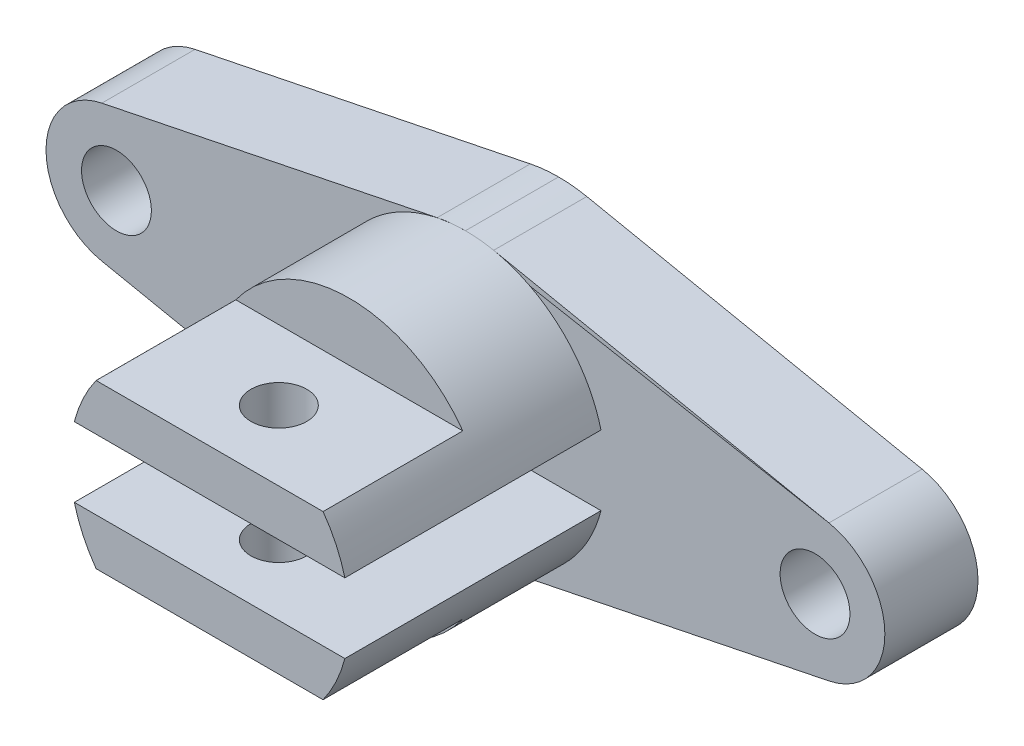
ISO-10303-21;
HEADER;
FILE_DESCRIPTION(('STEP AP214'),'2;1');
FILE_NAME('part.step','',(''),(''),'','','');
FILE_SCHEMA(('AUTOMOTIVE_DESIGN { 1 0 10303 214 1 1 1 1 }'));
ENDSEC;
DATA;
#1=APPLICATION_CONTEXT('core data for automotive mechanical design processes');
#2=APPLICATION_PROTOCOL_DEFINITION('international standard','automotive_design',2000,#1);
#3=PRODUCT_CONTEXT('',#1,'mechanical');
#4=PRODUCT('Part','Part','',(#3));
#5=PRODUCT_RELATED_PRODUCT_CATEGORY('part','',(#4));
#6=PRODUCT_DEFINITION_FORMATION('','',#4);
#7=PRODUCT_DEFINITION_CONTEXT('part definition',#1,'design');
#8=PRODUCT_DEFINITION('design','',#6,#7);
#9=PRODUCT_DEFINITION_SHAPE('','',#8);
#10=(LENGTH_UNIT() NAMED_UNIT(*) SI_UNIT(.MILLI.,.METRE.));
#11=(NAMED_UNIT(*) PLANE_ANGLE_UNIT() SI_UNIT($,.RADIAN.));
#12=(NAMED_UNIT(*) SI_UNIT($,.STERADIAN.) SOLID_ANGLE_UNIT());
#13=UNCERTAINTY_MEASURE_WITH_UNIT(LENGTH_MEASURE(1.E-05),#10,'distance_accuracy_value','');
#14=(GEOMETRIC_REPRESENTATION_CONTEXT(3) GLOBAL_UNCERTAINTY_ASSIGNED_CONTEXT((#13)) GLOBAL_UNIT_ASSIGNED_CONTEXT((#10,
#11,#12)) REPRESENTATION_CONTEXT('',''));
#15=CARTESIAN_POINT('',(0.,0.,0.));
#16=DIRECTION('',(0.,0.,1.));
#17=DIRECTION('',(1.,0.,0.));
#18=AXIS2_PLACEMENT_3D('',#15,#16,#17);
#19=CARTESIAN_POINT('',(-0.129107715143933,0.,20.));
#20=DIRECTION('',(0.,0.,-1.));
#21=DIRECTION('',(-1.,0.,0.));
#22=AXIS2_PLACEMENT_3D('',#19,#20,#21);
#23=PLANE('',#22);
#24=CARTESIAN_POINT('',(75.0000000000321,0.,20.));
#25=DIRECTION('',(0.,0.,1.));
#26=DIRECTION('',(1.,0.,0.));
#27=AXIS2_PLACEMENT_3D('',#24,#25,#26);
#28=CIRCLE('',#27,29.9999317535166);
#29=CARTESIAN_POINT('',(45.9526966346683,-7.50000482774365,20.));
#30=VERTEX_POINT('',#29);
#31=CARTESIAN_POINT('',(104.047303365396,-7.50000482774365,20.));
#32=VERTEX_POINT('',#31);
#33=EDGE_CURVE('E216',#30,#32,#28,.T.);
#34=ORIENTED_EDGE('',*,*,#33,.F.);
#35=DIRECTION('',(-1.,0.,0.));
#36=VECTOR('',#35,1.);
#37=CARTESIAN_POINT('',(45.9526966346683,-7.50000482774365,20.));
#38=LINE('',#37,#36);
#39=EDGE_CURVE('E211',#32,#30,#38,.T.);
#40=ORIENTED_EDGE('',*,*,#39,.F.);
#41=EDGE_LOOP('',(#34,#40));
#42=FACE_BOUND('',#41,.T.);
#43=CARTESIAN_POINT('',(-0.129107715143933,0.,20.));
#44=DIRECTION('',(0.,0.,-1.));
#45=DIRECTION('',(-1.,0.,0.));
#46=AXIS2_PLACEMENT_3D('',#43,#44,#45);
#47=CIRCLE('',#46,15.);
#48=CARTESIAN_POINT('',(-3.12910771514394,-14.696938456699,20.));
#49=VERTEX_POINT('',#48);
#50=CARTESIAN_POINT('',(-3.12910771514394,14.6969384566991,20.));
#51=VERTEX_POINT('',#50);
#52=EDGE_CURVE('E254',#49,#51,#47,.T.);
#53=ORIENTED_EDGE('',*,*,#52,.F.);
#54=DIRECTION('',(0.979795897113271,-0.200000000000001,0.));
#55=VECTOR('',#54,1.);
#56=CARTESIAN_POINT('',(-3.12910771514394,-14.696938456699,20.));
#57=LINE('',#56,#55);
#58=CARTESIAN_POINT('',(68.8708922848561,-29.3938769133981,20.));
#59=VERTEX_POINT('',#58);
#60=EDGE_CURVE('E287',#49,#59,#57,.T.);
#61=ORIENTED_EDGE('',*,*,#60,.T.);
#62=CARTESIAN_POINT('',(74.8708922848561,0.,20.));
#63=DIRECTION('',(0.,0.,-1.));
#64=DIRECTION('',(-1.,0.,0.));
#65=AXIS2_PLACEMENT_3D('',#62,#63,#64);
#66=CIRCLE('',#65,30.);
#67=CARTESIAN_POINT('',(74.935446142428,-29.9999305465775,20.));
#68=VERTEX_POINT('',#67);
#69=EDGE_CURVE('E283',#68,#59,#66,.T.);
#70=ORIENTED_EDGE('',*,*,#69,.F.);
#71=CARTESIAN_POINT('',(75.,0.,20.));
#72=DIRECTION('',(0.,0.,1.));
#73=DIRECTION('',(1.,0.,0.));
#74=AXIS2_PLACEMENT_3D('',#71,#72,#73);
#75=CIRCLE('',#74,30.);
#76=CARTESIAN_POINT('',(81.,-29.3938769133981,20.));
#77=VERTEX_POINT('',#76);
#78=EDGE_CURVE('E280',#68,#77,#75,.T.);
#79=ORIENTED_EDGE('',*,*,#78,.T.);
#80=DIRECTION('',(-0.979795897113271,-0.2,0.));
#81=VECTOR('',#80,1.);
#82=CARTESIAN_POINT('',(153.,-14.6969384566991,20.));
#83=LINE('',#82,#81);
#84=CARTESIAN_POINT('',(153.,-14.6969384566991,20.));
#85=VERTEX_POINT('',#84);
#86=EDGE_CURVE('E276',#85,#77,#83,.T.);
#87=ORIENTED_EDGE('',*,*,#86,.F.);
#88=CARTESIAN_POINT('',(150.,0.,20.));
#89=DIRECTION('',(0.,0.,1.));
#90=DIRECTION('',(1.,0.,0.));
#91=AXIS2_PLACEMENT_3D('',#88,#89,#90);
#92=CIRCLE('',#91,15.);
#93=CARTESIAN_POINT('',(153.,14.6969384566991,20.));
#94=VERTEX_POINT('',#93);
#95=EDGE_CURVE('E273',#85,#94,#92,.T.);
#96=ORIENTED_EDGE('',*,*,#95,.T.);
#97=DIRECTION('',(-0.979795897113271,0.2,0.));
#98=VECTOR('',#97,1.);
#99=CARTESIAN_POINT('',(153.,14.6969384566991,20.));
#100=LINE('',#99,#98);
#101=CARTESIAN_POINT('',(81.,29.3938769133981,20.));
#102=VERTEX_POINT('',#101);
#103=EDGE_CURVE('E270',#94,#102,#100,.T.);
#104=ORIENTED_EDGE('',*,*,#103,.T.);
#105=CARTESIAN_POINT('',(75.,0.,20.));
#106=DIRECTION('',(0.,0.,1.));
#107=DIRECTION('',(1.,0.,0.));
#108=AXIS2_PLACEMENT_3D('',#105,#106,#107);
#109=CIRCLE('',#108,30.);
#110=CARTESIAN_POINT('',(74.935446142428,29.9999305465775,20.));
#111=VERTEX_POINT('',#110);
#112=EDGE_CURVE('E267',#102,#111,#109,.T.);
#113=ORIENTED_EDGE('',*,*,#112,.T.);
#114=CARTESIAN_POINT('',(74.8708922848561,0.,20.));
#115=DIRECTION('',(0.,0.,-1.));
#116=DIRECTION('',(-1.,0.,0.));
#117=AXIS2_PLACEMENT_3D('',#114,#115,#116);
#118=CIRCLE('',#117,30.);
#119=CARTESIAN_POINT('',(68.8708922848561,29.3938769133981,20.));
#120=VERTEX_POINT('',#119);
#121=EDGE_CURVE('E263',#120,#111,#118,.T.);
#122=ORIENTED_EDGE('',*,*,#121,.F.);
#123=DIRECTION('',(0.979795897113272,0.199999999999999,0.));
#124=VECTOR('',#123,1.);
#125=CARTESIAN_POINT('',(-3.12910771514394,14.6969384566991,20.));
#126=LINE('',#125,#124);
#127=EDGE_CURVE('E258',#51,#120,#126,.T.);
#128=ORIENTED_EDGE('',*,*,#127,.F.);
#129=EDGE_LOOP('',(#53,#61,#70,#79,#87,#96,#104,#113,#122,#128));
#130=FACE_BOUND('',#129,.T.);
#131=CARTESIAN_POINT('',(75.0000000000321,0.,20.));
#132=DIRECTION('',(0.,0.,1.));
#133=DIRECTION('',(1.,0.,0.));
#134=AXIS2_PLACEMENT_3D('',#131,#132,#133);
#135=CIRCLE('',#134,29.9999317535166);
#136=CARTESIAN_POINT('',(104.047305858438,7.49999517225635,20.));
#137=VERTEX_POINT('',#136);
#138=CARTESIAN_POINT('',(45.9526941416262,7.49999517225635,20.));
#139=VERTEX_POINT('',#138);
#140=EDGE_CURVE('E220',#137,#139,#135,.T.);
#141=ORIENTED_EDGE('',*,*,#140,.F.);
#142=DIRECTION('',(1.,0.,0.));
#143=VECTOR('',#142,1.);
#144=CARTESIAN_POINT('',(45.9526941416262,7.49999517225635,20.));
#145=LINE('',#144,#143);
#146=EDGE_CURVE('E240',#139,#137,#145,.T.);
#147=ORIENTED_EDGE('',*,*,#146,.F.);
#148=EDGE_LOOP('',(#141,#147));
#149=FACE_BOUND('',#148,.T.);
#150=CARTESIAN_POINT('',(150.002572470873,-0.00643199145704265,20.));
#151=DIRECTION('',(0.,0.,-1.));
#152=DIRECTION('',(-1.,0.,0.));
#153=AXIS2_PLACEMENT_3D('',#150,#151,#152);
#154=CIRCLE('',#153,7.49999999999997);
#155=CARTESIAN_POINT('',(142.502572470873,-0.00643199145704265,20.));
#156=VERTEX_POINT('',#155);
#157=EDGE_CURVE('E371',#156,#156,#154,.T.);
#158=ORIENTED_EDGE('',*,*,#157,.T.);
#159=EDGE_LOOP('',(#158));
#160=FACE_BOUND('',#159,.T.);
#161=CARTESIAN_POINT('',(0.,0.,20.));
#162=DIRECTION('',(0.,0.,1.));
#163=DIRECTION('',(1.,0.,0.));
#164=AXIS2_PLACEMENT_3D('',#161,#162,#163);
#165=CIRCLE('',#164,7.5);
#166=CARTESIAN_POINT('',(7.5,0.,20.));
#167=VERTEX_POINT('',#166);
#168=EDGE_CURVE('E363',#167,#167,#165,.T.);
#169=ORIENTED_EDGE('',*,*,#168,.F.);
#170=EDGE_LOOP('',(#169));
#171=FACE_BOUND('',#170,.T.);
#172=ADVANCED_FACE('F45',(#42,#130,#149,#160,#171),#23,.F.);
#173=CARTESIAN_POINT('',(-0.129107715143933,0.,0.));
#174=DIRECTION('',(0.,0.,-1.));
#175=DIRECTION('',(-1.,0.,0.));
#176=AXIS2_PLACEMENT_3D('',#173,#174,#175);
#177=PLANE('',#176);
#178=CARTESIAN_POINT('',(150.002572470873,-0.00643199145704265,0.));
#179=DIRECTION('',(0.,0.,-1.));
#180=DIRECTION('',(-1.,0.,0.));
#181=AXIS2_PLACEMENT_3D('',#178,#179,#180);
#182=CIRCLE('',#181,7.49999999999997);
#183=CARTESIAN_POINT('',(142.502572470873,-0.00643199145704265,0.));
#184=VERTEX_POINT('',#183);
#185=EDGE_CURVE('E360',#184,#184,#182,.F.);
#186=ORIENTED_EDGE('',*,*,#185,.T.);
#187=EDGE_LOOP('',(#186));
#188=FACE_BOUND('',#187,.T.);
#189=CARTESIAN_POINT('',(-0.129107715143933,0.,0.));
#190=DIRECTION('',(0.,0.,-1.));
#191=DIRECTION('',(-1.,0.,0.));
#192=AXIS2_PLACEMENT_3D('',#189,#190,#191);
#193=CIRCLE('',#192,15.);
#194=CARTESIAN_POINT('',(-3.12910771514394,-14.696938456699,0.));
#195=VERTEX_POINT('',#194);
#196=CARTESIAN_POINT('',(-3.12910771514394,14.6969384566991,0.));
#197=VERTEX_POINT('',#196);
#198=EDGE_CURVE('E230',#195,#197,#193,.T.);
#199=ORIENTED_EDGE('',*,*,#198,.T.);
#200=DIRECTION('',(0.979795897113272,0.199999999999999,0.));
#201=VECTOR('',#200,1.);
#202=CARTESIAN_POINT('',(-3.12910771514394,14.6969384566991,0.));
#203=LINE('',#202,#201);
#204=CARTESIAN_POINT('',(68.8708922848561,29.3938769133981,0.));
#205=VERTEX_POINT('',#204);
#206=EDGE_CURVE('E294',#197,#205,#203,.T.);
#207=ORIENTED_EDGE('',*,*,#206,.T.);
#208=CARTESIAN_POINT('',(74.8708922848561,0.,0.));
#209=DIRECTION('',(0.,0.,-1.));
#210=DIRECTION('',(-1.,0.,0.));
#211=AXIS2_PLACEMENT_3D('',#208,#209,#210);
#212=CIRCLE('',#211,30.);
#213=CARTESIAN_POINT('',(74.935446142428,29.9999305465775,0.));
#214=VERTEX_POINT('',#213);
#215=EDGE_CURVE('E298',#205,#214,#212,.T.);
#216=ORIENTED_EDGE('',*,*,#215,.T.);
#217=CARTESIAN_POINT('',(75.,0.,0.));
#218=DIRECTION('',(0.,0.,1.));
#219=DIRECTION('',(1.,0.,0.));
#220=AXIS2_PLACEMENT_3D('',#217,#218,#219);
#221=CIRCLE('',#220,30.);
#222=CARTESIAN_POINT('',(81.,29.3938769133981,0.));
#223=VERTEX_POINT('',#222);
#224=EDGE_CURVE('E302',#223,#214,#221,.T.);
#225=ORIENTED_EDGE('',*,*,#224,.F.);
#226=DIRECTION('',(-0.979795897113271,0.2,0.));
#227=VECTOR('',#226,1.);
#228=CARTESIAN_POINT('',(153.,14.6969384566991,0.));
#229=LINE('',#228,#227);
#230=CARTESIAN_POINT('',(153.,14.6969384566991,0.));
#231=VERTEX_POINT('',#230);
#232=EDGE_CURVE('E306',#231,#223,#229,.T.);
#233=ORIENTED_EDGE('',*,*,#232,.F.);
#234=CARTESIAN_POINT('',(150.,0.,0.));
#235=DIRECTION('',(0.,0.,1.));
#236=DIRECTION('',(1.,0.,0.));
#237=AXIS2_PLACEMENT_3D('',#234,#235,#236);
#238=CIRCLE('',#237,15.);
#239=CARTESIAN_POINT('',(153.,-14.6969384566991,0.));
#240=VERTEX_POINT('',#239);
#241=EDGE_CURVE('E309',#240,#231,#238,.T.);
#242=ORIENTED_EDGE('',*,*,#241,.F.);
#243=DIRECTION('',(-0.979795897113271,-0.2,0.));
#244=VECTOR('',#243,1.);
#245=CARTESIAN_POINT('',(153.,-14.6969384566991,0.));
#246=LINE('',#245,#244);
#247=CARTESIAN_POINT('',(81.,-29.3938769133981,0.));
#248=VERTEX_POINT('',#247);
#249=EDGE_CURVE('E312',#240,#248,#246,.T.);
#250=ORIENTED_EDGE('',*,*,#249,.T.);
#251=CARTESIAN_POINT('',(75.,0.,0.));
#252=DIRECTION('',(0.,0.,1.));
#253=DIRECTION('',(1.,0.,0.));
#254=AXIS2_PLACEMENT_3D('',#251,#252,#253);
#255=CIRCLE('',#254,30.);
#256=CARTESIAN_POINT('',(74.935446142428,-29.9999305465775,0.));
#257=VERTEX_POINT('',#256);
#258=EDGE_CURVE('E316',#257,#248,#255,.T.);
#259=ORIENTED_EDGE('',*,*,#258,.F.);
#260=CARTESIAN_POINT('',(74.8708922848561,0.,0.));
#261=DIRECTION('',(0.,0.,-1.));
#262=DIRECTION('',(-1.,0.,0.));
#263=AXIS2_PLACEMENT_3D('',#260,#261,#262);
#264=CIRCLE('',#263,30.);
#265=CARTESIAN_POINT('',(68.8708922848561,-29.3938769133981,0.));
#266=VERTEX_POINT('',#265);
#267=EDGE_CURVE('E320',#257,#266,#264,.T.);
#268=ORIENTED_EDGE('',*,*,#267,.T.);
#269=DIRECTION('',(0.979795897113271,-0.200000000000001,0.));
#270=VECTOR('',#269,1.);
#271=CARTESIAN_POINT('',(-3.12910771514394,-14.696938456699,0.));
#272=LINE('',#271,#270);
#273=EDGE_CURVE('E259',#195,#266,#272,.T.);
#274=ORIENTED_EDGE('',*,*,#273,.F.);
#275=EDGE_LOOP('',(#199,#207,#216,#225,#233,#242,#250,#259,#268,#274));
#276=FACE_BOUND('',#275,.T.);
#277=CARTESIAN_POINT('',(0.,0.,0.));
#278=DIRECTION('',(0.,0.,-1.));
#279=DIRECTION('',(-1.,0.,0.));
#280=AXIS2_PLACEMENT_3D('',#277,#278,#279);
#281=CIRCLE('',#280,7.5);
#282=CARTESIAN_POINT('',(-7.5,0.,0.));
#283=VERTEX_POINT('',#282);
#284=EDGE_CURVE('E49',#283,#283,#281,.T.);
#285=ORIENTED_EDGE('',*,*,#284,.F.);
#286=EDGE_LOOP('',(#285));
#287=FACE_BOUND('',#286,.T.);
#288=ADVANCED_FACE('F430',(#188,#276,#287),#177,.T.);
#289=CARTESIAN_POINT('',(-0.129107715143933,0.,20.));
#290=DIRECTION('',(0.,0.,-1.));
#291=DIRECTION('',(-1.,0.,0.));
#292=AXIS2_PLACEMENT_3D('',#289,#290,#291);
#293=CYLINDRICAL_SURFACE('',#292,15.);
#294=ORIENTED_EDGE('',*,*,#198,.F.);
#295=DIRECTION('',(0.,0.,-1.));
#296=VECTOR('',#295,1.);
#297=CARTESIAN_POINT('',(-3.12910771514394,-14.696938456699,20.));
#298=LINE('',#297,#296);
#299=EDGE_CURVE('E188',#49,#195,#298,.T.);
#300=ORIENTED_EDGE('',*,*,#299,.F.);
#301=ORIENTED_EDGE('',*,*,#52,.T.);
#302=DIRECTION('',(0.,0.,-1.));
#303=VECTOR('',#302,1.);
#304=CARTESIAN_POINT('',(-3.12910771514394,14.6969384566991,20.));
#305=LINE('',#304,#303);
#306=EDGE_CURVE('E290',#51,#197,#305,.T.);
#307=ORIENTED_EDGE('',*,*,#306,.T.);
#308=EDGE_LOOP('',(#294,#300,#301,#307));
#309=FACE_BOUND('',#308,.T.);
#310=ADVANCED_FACE('F47',(#309),#293,.T.);
#311=CARTESIAN_POINT('',(-3.12910771514394,-14.696938456699,20.));
#312=DIRECTION('',(0.200000000000001,0.979795897113271,0.));
#313=DIRECTION('',(-0.979795897113271,0.200000000000001,0.));
#314=AXIS2_PLACEMENT_3D('',#311,#312,#313);
#315=PLANE('',#314);
#316=ORIENTED_EDGE('',*,*,#273,.T.);
#317=DIRECTION('',(0.,0.,-1.));
#318=VECTOR('',#317,1.);
#319=CARTESIAN_POINT('',(68.8708922848561,-29.3938769133981,20.));
#320=LINE('',#319,#318);
#321=EDGE_CURVE('E329',#59,#266,#320,.T.);
#322=ORIENTED_EDGE('',*,*,#321,.F.);
#323=ORIENTED_EDGE('',*,*,#60,.F.);
#324=ORIENTED_EDGE('',*,*,#299,.T.);
#325=EDGE_LOOP('',(#316,#322,#323,#324));
#326=FACE_BOUND('',#325,.T.);
#327=ADVANCED_FACE('F490',(#326),#315,.F.);
#328=CARTESIAN_POINT('',(74.8708922848561,0.,20.));
#329=DIRECTION('',(0.,0.,-1.));
#330=DIRECTION('',(-1.,0.,0.));
#331=AXIS2_PLACEMENT_3D('',#328,#329,#330);
#332=CYLINDRICAL_SURFACE('',#331,30.);
#333=ORIENTED_EDGE('',*,*,#267,.F.);
#334=DIRECTION('',(0.,0.,-1.));
#335=VECTOR('',#334,1.);
#336=CARTESIAN_POINT('',(74.935446142428,-29.9999305465775,20.));
#337=LINE('',#336,#335);
#338=EDGE_CURVE('E332',#68,#257,#337,.T.);
#339=ORIENTED_EDGE('',*,*,#338,.F.);
#340=ORIENTED_EDGE('',*,*,#69,.T.);
#341=ORIENTED_EDGE('',*,*,#321,.T.);
#342=EDGE_LOOP('',(#333,#339,#340,#341));
#343=FACE_BOUND('',#342,.T.);
#344=ADVANCED_FACE('F493',(#343),#332,.T.);
#345=CARTESIAN_POINT('',(75.,0.,20.));
#346=DIRECTION('',(0.,0.,-1.));
#347=DIRECTION('',(-1.,0.,0.));
#348=AXIS2_PLACEMENT_3D('',#345,#346,#347);
#349=CYLINDRICAL_SURFACE('',#348,30.);
#350=ORIENTED_EDGE('',*,*,#258,.T.);
#351=DIRECTION('',(0.,0.,-1.));
#352=VECTOR('',#351,1.);
#353=CARTESIAN_POINT('',(81.,-29.3938769133981,20.));
#354=LINE('',#353,#352);
#355=EDGE_CURVE('E335',#77,#248,#354,.T.);
#356=ORIENTED_EDGE('',*,*,#355,.F.);
#357=ORIENTED_EDGE('',*,*,#78,.F.);
#358=ORIENTED_EDGE('',*,*,#338,.T.);
#359=EDGE_LOOP('',(#350,#356,#357,#358));
#360=FACE_BOUND('',#359,.T.);
#361=ADVANCED_FACE('F497',(#360),#349,.T.);
#362=CARTESIAN_POINT('',(153.,-14.6969384566991,20.));
#363=DIRECTION('',(0.2,-0.979795897113271,0.));
#364=DIRECTION('',(0.979795897113271,0.2,0.));
#365=AXIS2_PLACEMENT_3D('',#362,#363,#364);
#366=PLANE('',#365);
#367=ORIENTED_EDGE('',*,*,#249,.F.);
#368=DIRECTION('',(0.,0.,-1.));
#369=VECTOR('',#368,1.);
#370=CARTESIAN_POINT('',(153.,-14.6969384566991,20.));
#371=LINE('',#370,#369);
#372=EDGE_CURVE('E338',#85,#240,#371,.T.);
#373=ORIENTED_EDGE('',*,*,#372,.F.);
#374=ORIENTED_EDGE('',*,*,#86,.T.);
#375=ORIENTED_EDGE('',*,*,#355,.T.);
#376=EDGE_LOOP('',(#367,#373,#374,#375));
#377=FACE_BOUND('',#376,.T.);
#378=ADVANCED_FACE('F501',(#377),#366,.T.);
#379=CARTESIAN_POINT('',(150.,0.,20.));
#380=DIRECTION('',(0.,0.,-1.));
#381=DIRECTION('',(-1.,0.,0.));
#382=AXIS2_PLACEMENT_3D('',#379,#380,#381);
#383=CYLINDRICAL_SURFACE('',#382,15.);
#384=ORIENTED_EDGE('',*,*,#241,.T.);
#385=DIRECTION('',(0.,0.,-1.));
#386=VECTOR('',#385,1.);
#387=CARTESIAN_POINT('',(153.,14.6969384566991,20.));
#388=LINE('',#387,#386);
#389=EDGE_CURVE('E341',#94,#231,#388,.T.);
#390=ORIENTED_EDGE('',*,*,#389,.F.);
#391=ORIENTED_EDGE('',*,*,#95,.F.);
#392=ORIENTED_EDGE('',*,*,#372,.T.);
#393=EDGE_LOOP('',(#384,#390,#391,#392));
#394=FACE_BOUND('',#393,.T.);
#395=ADVANCED_FACE('F505',(#394),#383,.T.);
#396=CARTESIAN_POINT('',(153.,14.6969384566991,20.));
#397=DIRECTION('',(-0.2,-0.979795897113271,0.));
#398=DIRECTION('',(0.979795897113271,-0.2,0.));
#399=AXIS2_PLACEMENT_3D('',#396,#397,#398);
#400=PLANE('',#399);
#401=ORIENTED_EDGE('',*,*,#232,.T.);
#402=DIRECTION('',(0.,0.,-1.));
#403=VECTOR('',#402,1.);
#404=CARTESIAN_POINT('',(81.,29.3938769133981,20.));
#405=LINE('',#404,#403);
#406=EDGE_CURVE('E345',#102,#223,#405,.T.);
#407=ORIENTED_EDGE('',*,*,#406,.F.);
#408=ORIENTED_EDGE('',*,*,#103,.F.);
#409=ORIENTED_EDGE('',*,*,#389,.T.);
#410=EDGE_LOOP('',(#401,#407,#408,#409));
#411=FACE_BOUND('',#410,.T.);
#412=ADVANCED_FACE('F509',(#411),#400,.F.);
#413=CARTESIAN_POINT('',(75.,0.,20.));
#414=DIRECTION('',(0.,0.,-1.));
#415=DIRECTION('',(-1.,0.,0.));
#416=AXIS2_PLACEMENT_3D('',#413,#414,#415);
#417=CYLINDRICAL_SURFACE('',#416,30.);
#418=ORIENTED_EDGE('',*,*,#224,.T.);
#419=DIRECTION('',(0.,0.,-1.));
#420=VECTOR('',#419,1.);
#421=CARTESIAN_POINT('',(74.935446142428,29.9999305465775,20.));
#422=LINE('',#421,#420);
#423=EDGE_CURVE('E349',#111,#214,#422,.T.);
#424=ORIENTED_EDGE('',*,*,#423,.F.);
#425=ORIENTED_EDGE('',*,*,#112,.F.);
#426=ORIENTED_EDGE('',*,*,#406,.T.);
#427=EDGE_LOOP('',(#418,#424,#425,#426));
#428=FACE_BOUND('',#427,.T.);
#429=ADVANCED_FACE('F513',(#428),#417,.T.);
#430=CARTESIAN_POINT('',(74.8708922848561,0.,20.));
#431=DIRECTION('',(0.,0.,-1.));
#432=DIRECTION('',(-1.,0.,0.));
#433=AXIS2_PLACEMENT_3D('',#430,#431,#432);
#434=CYLINDRICAL_SURFACE('',#433,30.);
#435=ORIENTED_EDGE('',*,*,#215,.F.);
#436=DIRECTION('',(0.,0.,-1.));
#437=VECTOR('',#436,1.);
#438=CARTESIAN_POINT('',(68.8708922848561,29.3938769133981,20.));
#439=LINE('',#438,#437);
#440=EDGE_CURVE('E352',#120,#205,#439,.T.);
#441=ORIENTED_EDGE('',*,*,#440,.F.);
#442=ORIENTED_EDGE('',*,*,#121,.T.);
#443=ORIENTED_EDGE('',*,*,#423,.T.);
#444=EDGE_LOOP('',(#435,#441,#442,#443));
#445=FACE_BOUND('',#444,.T.);
#446=ADVANCED_FACE('F517',(#445),#434,.T.);
#447=CARTESIAN_POINT('',(-3.12910771514394,14.6969384566991,20.));
#448=DIRECTION('',(-0.199999999999999,0.979795897113272,0.));
#449=DIRECTION('',(-0.979795897113272,-0.199999999999999,0.));
#450=AXIS2_PLACEMENT_3D('',#447,#448,#449);
#451=PLANE('',#450);
#452=ORIENTED_EDGE('',*,*,#206,.F.);
#453=ORIENTED_EDGE('',*,*,#306,.F.);
#454=ORIENTED_EDGE('',*,*,#127,.T.);
#455=ORIENTED_EDGE('',*,*,#440,.T.);
#456=EDGE_LOOP('',(#452,#453,#454,#455));
#457=FACE_BOUND('',#456,.T.);
#458=ADVANCED_FACE('F483',(#457),#451,.T.);
#459=CARTESIAN_POINT('',(75.0000000000321,0.,75.));
#460=DIRECTION('',(0.,0.,-1.));
#461=DIRECTION('',(-1.,0.,0.));
#462=AXIS2_PLACEMENT_3D('',#459,#460,#461);
#463=CYLINDRICAL_SURFACE('',#462,29.9999317535166);
#464=CARTESIAN_POINT('',(75.0000000000321,0.,45.));
#465=DIRECTION('',(0.,0.,-1.));
#466=DIRECTION('',(-1.,0.,0.));
#467=AXIS2_PLACEMENT_3D('',#464,#465,#466);
#468=CIRCLE('',#467,29.9999317535166);
#469=CARTESIAN_POINT('',(50.6311842445613,17.4973347653742,45.));
#470=VERTEX_POINT('',#469);
#471=CARTESIAN_POINT('',(99.3718164844499,17.4931548459823,45.));
#472=VERTEX_POINT('',#471);
#473=EDGE_CURVE('E11',#470,#472,#468,.T.);
#474=ORIENTED_EDGE('',*,*,#473,.T.);
#475=DIRECTION('',(0.,0.,-1.));
#476=VECTOR('',#475,1.);
#477=CARTESIAN_POINT('',(99.3718164844499,17.4931548459823,75.));
#478=LINE('',#477,#476);
#479=CARTESIAN_POINT('',(99.3718164844499,17.4931548459823,75.));
#480=VERTEX_POINT('',#479);
#481=EDGE_CURVE('E213',#472,#480,#478,.F.);
#482=ORIENTED_EDGE('',*,*,#481,.T.);
#483=CARTESIAN_POINT('',(75.0000000000321,0.,75.));
#484=DIRECTION('',(0.,0.,1.));
#485=DIRECTION('',(1.,0.,0.));
#486=AXIS2_PLACEMENT_3D('',#483,#484,#485);
#487=CIRCLE('',#486,29.9999317535166);
#488=CARTESIAN_POINT('',(104.047305858438,7.49999517225635,75.));
#489=VERTEX_POINT('',#488);
#490=EDGE_CURVE('E244',#489,#480,#487,.T.);
#491=ORIENTED_EDGE('',*,*,#490,.F.);
#492=DIRECTION('',(0.,0.,-1.));
#493=VECTOR('',#492,1.);
#494=CARTESIAN_POINT('',(104.047305858438,7.49999517225635,75.));
#495=LINE('',#494,#493);
#496=EDGE_CURVE('E235',#489,#137,#495,.T.);
#497=ORIENTED_EDGE('',*,*,#496,.T.);
#498=ORIENTED_EDGE('',*,*,#140,.T.);
#499=DIRECTION('',(0.,0.,-1.));
#500=VECTOR('',#499,1.);
#501=CARTESIAN_POINT('',(45.9526941416262,7.49999517225635,75.));
#502=LINE('',#501,#500);
#503=CARTESIAN_POINT('',(45.9526941416262,7.49999517225635,75.));
#504=VERTEX_POINT('',#503);
#505=EDGE_CURVE('E231',#504,#139,#502,.T.);
#506=ORIENTED_EDGE('',*,*,#505,.F.);
#507=CARTESIAN_POINT('',(50.6311842445613,17.4973347653742,75.));
#508=VERTEX_POINT('',#507);
#509=EDGE_CURVE('E250',#508,#504,#487,.T.);
#510=ORIENTED_EDGE('',*,*,#509,.F.);
#511=DIRECTION('',(0.,0.,-1.));
#512=VECTOR('',#511,1.);
#513=CARTESIAN_POINT('',(50.6311842445613,17.4973347653742,75.));
#514=LINE('',#513,#512);
#515=EDGE_CURVE('E63',#508,#470,#514,.T.);
#516=ORIENTED_EDGE('',*,*,#515,.T.);
#517=EDGE_LOOP('',(#474,#482,#491,#497,#498,#506,#510,#516));
#518=FACE_BOUND('',#517,.T.);
#519=ADVANCED_FACE('F416',(#518),#463,.T.);
#520=CARTESIAN_POINT('',(45.9526941416262,7.49999517225635,75.));
#521=DIRECTION('',(0.,1.,0.));
#522=DIRECTION('',(0.,0.,1.));
#523=AXIS2_PLACEMENT_3D('',#520,#521,#522);
#524=PLANE('',#523);
#525=CARTESIAN_POINT('',(74.8708922848561,7.49999517225635,60.));
#526=DIRECTION('',(0.,1.,0.));
#527=DIRECTION('',(0.,0.,1.));
#528=AXIS2_PLACEMENT_3D('',#525,#526,#527);
#529=CIRCLE('',#528,6.);
#530=CARTESIAN_POINT('',(74.8708922848561,7.49999517225635,66.));
#531=VERTEX_POINT('',#530);
#532=EDGE_CURVE('E198',#531,#531,#529,.T.);
#533=ORIENTED_EDGE('',*,*,#532,.T.);
#534=EDGE_LOOP('',(#533));
#535=FACE_BOUND('',#534,.T.);
#536=ORIENTED_EDGE('',*,*,#146,.T.);
#537=ORIENTED_EDGE('',*,*,#496,.F.);
#538=DIRECTION('',(1.,0.,0.));
#539=VECTOR('',#538,1.);
#540=CARTESIAN_POINT('',(45.9526941416262,7.49999517225635,75.));
#541=LINE('',#540,#539);
#542=EDGE_CURVE('E239',#504,#489,#541,.T.);
#543=ORIENTED_EDGE('',*,*,#542,.F.);
#544=ORIENTED_EDGE('',*,*,#505,.T.);
#545=EDGE_LOOP('',(#536,#537,#543,#544));
#546=FACE_BOUND('',#545,.T.);
#547=ADVANCED_FACE('F426',(#535,#546),#524,.F.);
#548=CARTESIAN_POINT('',(75.0000000000321,0.,75.));
#549=DIRECTION('',(0.,0.,1.));
#550=DIRECTION('',(1.,0.,0.));
#551=AXIS2_PLACEMENT_3D('',#548,#549,#550);
#552=PLANE('',#551);
#553=DIRECTION('',(1.,0.,0.));
#554=VECTOR('',#553,1.);
#555=CARTESIAN_POINT('',(50.6311842445613,17.4931548459823,75.));
#556=LINE('',#555,#554);
#557=CARTESIAN_POINT('',(50.6311842445613,17.4931548459823,75.));
#558=VERTEX_POINT('',#557);
#559=EDGE_CURVE('E396',#558,#480,#556,.T.);
#560=ORIENTED_EDGE('',*,*,#559,.F.);
#561=DIRECTION('',(0.,-1.,0.));
#562=VECTOR('',#561,1.);
#563=CARTESIAN_POINT('',(50.6311842445613,0.,75.));
#564=LINE('',#563,#562);
#565=EDGE_CURVE('E55',#508,#558,#564,.T.);
#566=ORIENTED_EDGE('',*,*,#565,.F.);
#567=ORIENTED_EDGE('',*,*,#509,.T.);
#568=ORIENTED_EDGE('',*,*,#542,.T.);
#569=ORIENTED_EDGE('',*,*,#490,.T.);
#570=EDGE_LOOP('',(#560,#566,#567,#568,#569));
#571=FACE_BOUND('',#570,.T.);
#572=ADVANCED_FACE('F421',(#571),#552,.T.);
#573=CARTESIAN_POINT('',(75.0000000000321,0.,75.));
#574=DIRECTION('',(0.,0.,-1.));
#575=DIRECTION('',(-1.,0.,0.));
#576=AXIS2_PLACEMENT_3D('',#573,#574,#575);
#577=CYLINDRICAL_SURFACE('',#576,29.9999317535166);
#578=CARTESIAN_POINT('',(75.0000000000321,0.,45.));
#579=DIRECTION('',(0.,0.,1.));
#580=DIRECTION('',(1.,0.,0.));
#581=AXIS2_PLACEMENT_3D('',#578,#579,#580);
#582=CIRCLE('',#581,29.9999317535166);
#583=CARTESIAN_POINT('',(50.6380157218806,-17.5068451540177,45.));
#584=VERTEX_POINT('',#583);
#585=CARTESIAN_POINT('',(99.3619842781835,-17.5068451540177,45.));
#586=VERTEX_POINT('',#585);
#587=EDGE_CURVE('E187',#584,#586,#582,.T.);
#588=ORIENTED_EDGE('',*,*,#587,.F.);
#589=DIRECTION('',(0.,0.,-1.));
#590=VECTOR('',#589,1.);
#591=CARTESIAN_POINT('',(50.6380157218806,-17.5068451540177,75.));
#592=LINE('',#591,#590);
#593=CARTESIAN_POINT('',(50.6380157218806,-17.5068451540177,75.));
#594=VERTEX_POINT('',#593);
#595=EDGE_CURVE('E182',#584,#594,#592,.F.);
#596=ORIENTED_EDGE('',*,*,#595,.T.);
#597=CARTESIAN_POINT('',(75.0000000000321,0.,75.));
#598=DIRECTION('',(0.,0.,1.));
#599=DIRECTION('',(1.,0.,0.));
#600=AXIS2_PLACEMENT_3D('',#597,#598,#599);
#601=CIRCLE('',#600,29.9999317535166);
#602=CARTESIAN_POINT('',(45.9526966346683,-7.50000482774365,75.));
#603=VERTEX_POINT('',#602);
#604=EDGE_CURVE('E194',#603,#594,#601,.T.);
#605=ORIENTED_EDGE('',*,*,#604,.F.);
#606=DIRECTION('',(0.,0.,-1.));
#607=VECTOR('',#606,1.);
#608=CARTESIAN_POINT('',(45.9526966346683,-7.50000482774365,75.));
#609=LINE('',#608,#607);
#610=EDGE_CURVE('E209',#603,#30,#609,.T.);
#611=ORIENTED_EDGE('',*,*,#610,.T.);
#612=ORIENTED_EDGE('',*,*,#33,.T.);
#613=DIRECTION('',(0.,0.,-1.));
#614=VECTOR('',#613,1.);
#615=CARTESIAN_POINT('',(104.047303365396,-7.50000482774365,75.));
#616=LINE('',#615,#614);
#617=CARTESIAN_POINT('',(104.047303365396,-7.50000482774365,75.));
#618=VERTEX_POINT('',#617);
#619=EDGE_CURVE('E226',#618,#32,#616,.T.);
#620=ORIENTED_EDGE('',*,*,#619,.F.);
#621=CARTESIAN_POINT('',(99.3619842781835,-17.5068451540177,75.));
#622=VERTEX_POINT('',#621);
#623=EDGE_CURVE('E205',#622,#618,#601,.T.);
#624=ORIENTED_EDGE('',*,*,#623,.F.);
#625=DIRECTION('',(0.,0.,-1.));
#626=VECTOR('',#625,1.);
#627=CARTESIAN_POINT('',(99.3619842781835,-17.5068451540177,75.));
#628=LINE('',#627,#626);
#629=EDGE_CURVE('E71',#622,#586,#628,.T.);
#630=ORIENTED_EDGE('',*,*,#629,.T.);
#631=EDGE_LOOP('',(#588,#596,#605,#611,#612,#620,#624,#630));
#632=FACE_BOUND('',#631,.T.);
#633=ADVANCED_FACE('F192',(#632),#577,.T.);
#634=CARTESIAN_POINT('',(45.9526966346683,-7.50000482774365,75.));
#635=DIRECTION('',(0.,-1.,0.));
#636=DIRECTION('',(1.,0.,0.));
#637=AXIS2_PLACEMENT_3D('',#634,#635,#636);
#638=PLANE('',#637);
#639=CARTESIAN_POINT('',(74.8708922848561,-7.50000482774365,60.));
#640=DIRECTION('',(0.,-1.,0.));
#641=DIRECTION('',(1.,0.,0.));
#642=AXIS2_PLACEMENT_3D('',#639,#640,#641);
#643=CIRCLE('',#642,6.);
#644=CARTESIAN_POINT('',(80.8708922848561,-7.50000482774365,60.));
#645=VERTEX_POINT('',#644);
#646=EDGE_CURVE('E386',#645,#645,#643,.T.);
#647=ORIENTED_EDGE('',*,*,#646,.T.);
#648=EDGE_LOOP('',(#647));
#649=FACE_BOUND('',#648,.T.);
#650=ORIENTED_EDGE('',*,*,#39,.T.);
#651=ORIENTED_EDGE('',*,*,#610,.F.);
#652=DIRECTION('',(-1.,0.,0.));
#653=VECTOR('',#652,1.);
#654=CARTESIAN_POINT('',(45.9526966346683,-7.50000482774365,75.));
#655=LINE('',#654,#653);
#656=EDGE_CURVE('E202',#618,#603,#655,.T.);
#657=ORIENTED_EDGE('',*,*,#656,.F.);
#658=ORIENTED_EDGE('',*,*,#619,.T.);
#659=EDGE_LOOP('',(#650,#651,#657,#658));
#660=FACE_BOUND('',#659,.T.);
#661=ADVANCED_FACE('F475',(#649,#660),#638,.F.);
#662=CARTESIAN_POINT('',(75.0000000000321,0.,75.));
#663=DIRECTION('',(0.,0.,1.));
#664=DIRECTION('',(1.,0.,0.));
#665=AXIS2_PLACEMENT_3D('',#662,#663,#664);
#666=PLANE('',#665);
#667=ORIENTED_EDGE('',*,*,#604,.T.);
#668=DIRECTION('',(-1.,0.,0.));
#669=VECTOR('',#668,1.);
#670=CARTESIAN_POINT('',(75.0000000000321,-17.5068451540177,75.));
#671=LINE('',#670,#669);
#672=EDGE_CURVE('E179',#622,#594,#671,.T.);
#673=ORIENTED_EDGE('',*,*,#672,.F.);
#674=ORIENTED_EDGE('',*,*,#623,.T.);
#675=ORIENTED_EDGE('',*,*,#656,.T.);
#676=EDGE_LOOP('',(#667,#673,#674,#675));
#677=FACE_BOUND('',#676,.T.);
#678=ADVANCED_FACE('F200',(#677),#666,.T.);
#679=CARTESIAN_POINT('',(75.0026905309959,-0.000549202339764439,45.));
#680=DIRECTION('',(0.,0.,1.));
#681=DIRECTION('',(1.,0.,0.));
#682=AXIS2_PLACEMENT_3D('',#679,#680,#681);
#683=PLANE('',#682);
#684=DIRECTION('',(-1.,0.,0.));
#685=VECTOR('',#684,1.);
#686=CARTESIAN_POINT('',(50.6402275591972,-17.5068451540177,45.));
#687=LINE('',#686,#685);
#688=EDGE_CURVE('E393',#586,#584,#687,.T.);
#689=ORIENTED_EDGE('',*,*,#688,.T.);
#690=ORIENTED_EDGE('',*,*,#587,.T.);
#691=EDGE_LOOP('',(#689,#690));
#692=FACE_BOUND('',#691,.T.);
#693=ADVANCED_FACE('F456',(#692),#683,.T.);
#694=CARTESIAN_POINT('',(50.6402275591972,-17.5068451540177,45.));
#695=DIRECTION('',(0.,1.,0.));
#696=DIRECTION('',(0.,0.,1.));
#697=AXIS2_PLACEMENT_3D('',#694,#695,#696);
#698=PLANE('',#697);
#699=CARTESIAN_POINT('',(74.8708922848561,-17.5068451540177,60.));
#700=DIRECTION('',(0.,1.,0.));
#701=DIRECTION('',(0.,0.,1.));
#702=AXIS2_PLACEMENT_3D('',#699,#700,#701);
#703=CIRCLE('',#702,6.);
#704=CARTESIAN_POINT('',(74.8708922848561,-17.5068451540177,66.));
#705=VERTEX_POINT('',#704);
#706=EDGE_CURVE('E382',#705,#705,#703,.T.);
#707=ORIENTED_EDGE('',*,*,#706,.T.);
#708=EDGE_LOOP('',(#707));
#709=FACE_BOUND('',#708,.T.);
#710=ORIENTED_EDGE('',*,*,#672,.T.);
#711=ORIENTED_EDGE('',*,*,#595,.F.);
#712=ORIENTED_EDGE('',*,*,#688,.F.);
#713=ORIENTED_EDGE('',*,*,#629,.F.);
#714=EDGE_LOOP('',(#710,#711,#712,#713));
#715=FACE_BOUND('',#714,.T.);
#716=ADVANCED_FACE('F181',(#709,#715),#698,.F.);
#717=CARTESIAN_POINT('',(0.,0.,45.));
#718=DIRECTION('',(0.,0.,-1.));
#719=DIRECTION('',(-1.,0.,0.));
#720=AXIS2_PLACEMENT_3D('',#717,#718,#719);
#721=PLANE('',#720);
#722=DIRECTION('',(0.,-1.,0.));
#723=VECTOR('',#722,1.);
#724=CARTESIAN_POINT('',(50.6311842445613,17.4931548459823,45.));
#725=LINE('',#724,#723);
#726=CARTESIAN_POINT('',(50.6311842445613,17.4931548459823,45.));
#727=VERTEX_POINT('',#726);
#728=EDGE_CURVE('E403',#470,#727,#725,.T.);
#729=ORIENTED_EDGE('',*,*,#728,.T.);
#730=DIRECTION('',(1.,0.,0.));
#731=VECTOR('',#730,1.);
#732=CARTESIAN_POINT('',(50.6311842445613,17.4931548459823,45.));
#733=LINE('',#732,#731);
#734=EDGE_CURVE('E400',#727,#472,#733,.T.);
#735=ORIENTED_EDGE('',*,*,#734,.T.);
#736=ORIENTED_EDGE('',*,*,#473,.F.);
#737=EDGE_LOOP('',(#729,#735,#736));
#738=FACE_BOUND('',#737,.T.);
#739=ADVANCED_FACE('F462',(#738),#721,.F.);
#740=CARTESIAN_POINT('',(50.6311842445613,17.4931548459823,45.));
#741=DIRECTION('',(0.,-1.,0.));
#742=DIRECTION('',(0.,0.,-1.));
#743=AXIS2_PLACEMENT_3D('',#740,#741,#742);
#744=PLANE('',#743);
#745=CARTESIAN_POINT('',(74.8708922848561,17.4931548459823,60.));
#746=DIRECTION('',(0.,1.,0.));
#747=DIRECTION('',(0.,0.,1.));
#748=AXIS2_PLACEMENT_3D('',#745,#746,#747);
#749=CIRCLE('',#748,6.);
#750=CARTESIAN_POINT('',(74.8708922848561,17.4931548459823,66.));
#751=VERTEX_POINT('',#750);
#752=EDGE_CURVE('E369',#751,#751,#749,.T.);
#753=ORIENTED_EDGE('',*,*,#752,.F.);
#754=EDGE_LOOP('',(#753));
#755=FACE_BOUND('',#754,.T.);
#756=ORIENTED_EDGE('',*,*,#734,.F.);
#757=DIRECTION('',(0.,0.,1.));
#758=VECTOR('',#757,1.);
#759=CARTESIAN_POINT('',(50.6311842445613,17.4931548459823,45.));
#760=LINE('',#759,#758);
#761=EDGE_CURVE('E197',#727,#558,#760,.T.);
#762=ORIENTED_EDGE('',*,*,#761,.T.);
#763=ORIENTED_EDGE('',*,*,#559,.T.);
#764=ORIENTED_EDGE('',*,*,#481,.F.);
#765=EDGE_LOOP('',(#756,#762,#763,#764));
#766=FACE_BOUND('',#765,.T.);
#767=ADVANCED_FACE('F466',(#755,#766),#744,.F.);
#768=CARTESIAN_POINT('',(50.6311842445613,17.4931548459823,45.));
#769=DIRECTION('',(-1.,0.,0.));
#770=DIRECTION('',(0.,0.,1.));
#771=AXIS2_PLACEMENT_3D('',#768,#769,#770);
#772=PLANE('',#771);
#773=ORIENTED_EDGE('',*,*,#565,.T.);
#774=ORIENTED_EDGE('',*,*,#761,.F.);
#775=ORIENTED_EDGE('',*,*,#728,.F.);
#776=ORIENTED_EDGE('',*,*,#515,.F.);
#777=EDGE_LOOP('',(#773,#774,#775,#776));
#778=FACE_BOUND('',#777,.T.);
#779=ADVANCED_FACE('F454',(#778),#772,.F.);
#780=CARTESIAN_POINT('',(74.8708922848561,-38.5068451540177,60.));
#781=DIRECTION('',(0.,1.,0.));
#782=DIRECTION('',(0.,0.,1.));
#783=AXIS2_PLACEMENT_3D('',#780,#781,#782);
#784=CYLINDRICAL_SURFACE('',#783,6.);
#785=ORIENTED_EDGE('',*,*,#752,.T.);
#786=EDGE_LOOP('',(#785));
#787=FACE_BOUND('',#786,.T.);
#788=ORIENTED_EDGE('',*,*,#532,.F.);
#789=EDGE_LOOP('',(#788));
#790=FACE_BOUND('',#789,.T.);
#791=ADVANCED_FACE('F449',(#787,#790),#784,.F.);
#792=ORIENTED_EDGE('',*,*,#706,.F.);
#793=EDGE_LOOP('',(#792));
#794=FACE_BOUND('',#793,.T.);
#795=ORIENTED_EDGE('',*,*,#646,.F.);
#796=EDGE_LOOP('',(#795));
#797=FACE_BOUND('',#796,.T.);
#798=ADVANCED_FACE('F439',(#794,#797),#784,.F.);
#799=CARTESIAN_POINT('',(150.002572470873,-0.00643199145704265,-36.));
#800=DIRECTION('',(0.,0.,1.));
#801=DIRECTION('',(1.,0.,0.));
#802=AXIS2_PLACEMENT_3D('',#799,#800,#801);
#803=CYLINDRICAL_SURFACE('',#802,7.49999999999997);
#804=ORIENTED_EDGE('',*,*,#185,.F.);
#805=EDGE_LOOP('',(#804));
#806=FACE_BOUND('',#805,.T.);
#807=ORIENTED_EDGE('',*,*,#157,.F.);
#808=EDGE_LOOP('',(#807));
#809=FACE_BOUND('',#808,.T.);
#810=ADVANCED_FACE('F436',(#806,#809),#803,.F.);
#811=CARTESIAN_POINT('',(0.,0.,-36.));
#812=DIRECTION('',(0.,0.,1.));
#813=DIRECTION('',(1.,0.,0.));
#814=AXIS2_PLACEMENT_3D('',#811,#812,#813);
#815=CYLINDRICAL_SURFACE('',#814,7.5);
#816=ORIENTED_EDGE('',*,*,#284,.T.);
#817=EDGE_LOOP('',(#816));
#818=FACE_BOUND('',#817,.T.);
#819=ORIENTED_EDGE('',*,*,#168,.T.);
#820=EDGE_LOOP('',(#819));
#821=FACE_BOUND('',#820,.T.);
#822=ADVANCED_FACE('F438',(#818,#821),#815,.F.);
#823=CLOSED_SHELL('',(#172,#288,#310,#327,#344,#361,#378,#395,#412,#429,#446,#458,#519,#547,
#572,#633,#661,#678,#693,#716,#739,#767,#779,#791,#798,#810,#822));
#824=MANIFOLD_SOLID_BREP('B2',#823);
#825=ADVANCED_BREP_SHAPE_REPRESENTATION('',(#18,#824),#14);
#826=SHAPE_DEFINITION_REPRESENTATION(#9,#825);
ENDSEC;
END-ISO-10303-21;
